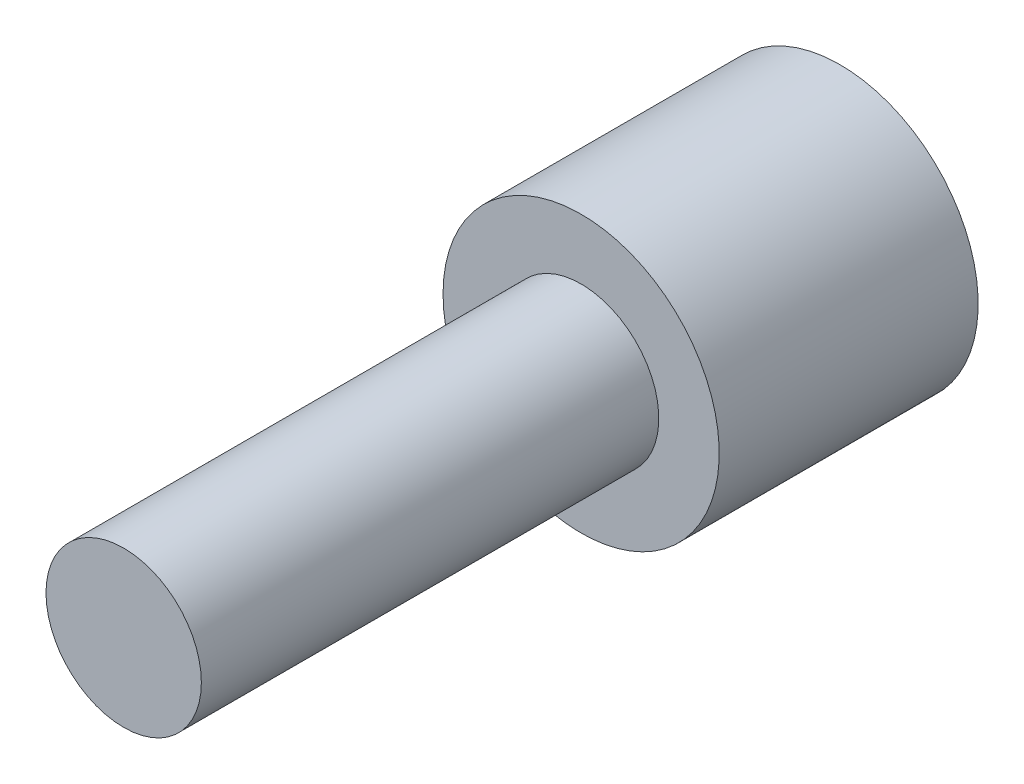
ISO-10303-21;
HEADER;
FILE_DESCRIPTION(('STEP AP214'),'2;1');
FILE_NAME('part.step','',(''),(''),'','','');
FILE_SCHEMA(('AUTOMOTIVE_DESIGN { 1 0 10303 214 1 1 1 1 }'));
ENDSEC;
DATA;
#1=APPLICATION_CONTEXT('core data for automotive mechanical design processes');
#2=APPLICATION_PROTOCOL_DEFINITION('international standard','automotive_design',2000,#1);
#3=PRODUCT_CONTEXT('',#1,'mechanical');
#4=PRODUCT('Part','Part','',(#3));
#5=PRODUCT_RELATED_PRODUCT_CATEGORY('part','',(#4));
#6=PRODUCT_DEFINITION_FORMATION('','',#4);
#7=PRODUCT_DEFINITION_CONTEXT('part definition',#1,'design');
#8=PRODUCT_DEFINITION('design','',#6,#7);
#9=PRODUCT_DEFINITION_SHAPE('','',#8);
#10=(LENGTH_UNIT() NAMED_UNIT(*) SI_UNIT(.MILLI.,.METRE.));
#11=(NAMED_UNIT(*) PLANE_ANGLE_UNIT() SI_UNIT($,.RADIAN.));
#12=(NAMED_UNIT(*) SI_UNIT($,.STERADIAN.) SOLID_ANGLE_UNIT());
#13=UNCERTAINTY_MEASURE_WITH_UNIT(LENGTH_MEASURE(1.E-05),#10,'distance_accuracy_value','');
#14=(GEOMETRIC_REPRESENTATION_CONTEXT(3) GLOBAL_UNCERTAINTY_ASSIGNED_CONTEXT((#13)) GLOBAL_UNIT_ASSIGNED_CONTEXT((#10,
#11,#12)) REPRESENTATION_CONTEXT('',''));
#15=CARTESIAN_POINT('',(0.,0.,0.));
#16=DIRECTION('',(0.,0.,1.));
#17=DIRECTION('',(1.,0.,0.));
#18=AXIS2_PLACEMENT_3D('',#15,#16,#17);
#19=CARTESIAN_POINT('',(0.,0.,16.6));
#20=DIRECTION('',(0.,0.,-1.));
#21=DIRECTION('',(-1.,0.,0.));
#22=AXIS2_PLACEMENT_3D('',#19,#20,#21);
#23=CYLINDRICAL_SURFACE('',#22,1.8);
#24=CARTESIAN_POINT('',(0.,0.,16.6));
#25=DIRECTION('',(0.,0.,1.));
#26=DIRECTION('',(1.,0.,0.));
#27=AXIS2_PLACEMENT_3D('',#24,#25,#26);
#28=CIRCLE('',#27,1.8);
#29=CARTESIAN_POINT('',(1.8,0.,16.6));
#30=VERTEX_POINT('',#29);
#31=EDGE_CURVE('E44',#30,#30,#28,.T.);
#32=ORIENTED_EDGE('',*,*,#31,.F.);
#33=EDGE_LOOP('',(#32));
#34=FACE_BOUND('',#33,.T.);
#35=CARTESIAN_POINT('',(0.,0.,6.));
#36=DIRECTION('',(0.,0.,-1.));
#37=DIRECTION('',(-1.,0.,0.));
#38=AXIS2_PLACEMENT_3D('',#35,#36,#37);
#39=CIRCLE('',#38,1.8);
#40=CARTESIAN_POINT('',(-1.8,0.,6.));
#41=VERTEX_POINT('',#40);
#42=EDGE_CURVE('E10',#41,#41,#39,.T.);
#43=ORIENTED_EDGE('',*,*,#42,.F.);
#44=EDGE_LOOP('',(#43));
#45=FACE_BOUND('',#44,.T.);
#46=ADVANCED_FACE('F37',(#34,#45),#23,.T.);
#47=CARTESIAN_POINT('',(0.,0.,16.6));
#48=DIRECTION('',(0.,0.,1.));
#49=DIRECTION('',(1.,0.,0.));
#50=AXIS2_PLACEMENT_3D('',#47,#48,#49);
#51=PLANE('',#50);
#52=ORIENTED_EDGE('',*,*,#31,.T.);
#53=EDGE_LOOP('',(#52));
#54=FACE_BOUND('',#53,.T.);
#55=ADVANCED_FACE('F66',(#54),#51,.T.);
#56=CARTESIAN_POINT('',(0.,0.,6.));
#57=DIRECTION('',(0.,0.,-1.));
#58=DIRECTION('',(-1.,0.,0.));
#59=AXIS2_PLACEMENT_3D('',#56,#57,#58);
#60=CYLINDRICAL_SURFACE('',#59,3.2);
#61=CARTESIAN_POINT('',(0.,0.,6.));
#62=DIRECTION('',(0.,0.,-1.));
#63=DIRECTION('',(-1.,0.,0.));
#64=AXIS2_PLACEMENT_3D('',#61,#62,#63);
#65=CIRCLE('',#64,3.2);
#66=CARTESIAN_POINT('',(-3.2,0.,6.));
#67=VERTEX_POINT('',#66);
#68=EDGE_CURVE('E49',#67,#67,#65,.T.);
#69=ORIENTED_EDGE('',*,*,#68,.T.);
#70=EDGE_LOOP('',(#69));
#71=FACE_BOUND('',#70,.T.);
#72=CARTESIAN_POINT('',(0.,0.,0.));
#73=DIRECTION('',(0.,0.,-1.));
#74=DIRECTION('',(-1.,0.,0.));
#75=AXIS2_PLACEMENT_3D('',#72,#73,#74);
#76=CIRCLE('',#75,3.2);
#77=CARTESIAN_POINT('',(-3.2,0.,0.));
#78=VERTEX_POINT('',#77);
#79=EDGE_CURVE('E54',#78,#78,#76,.T.);
#80=ORIENTED_EDGE('',*,*,#79,.F.);
#81=EDGE_LOOP('',(#80));
#82=FACE_BOUND('',#81,.T.);
#83=ADVANCED_FACE('F63',(#71,#82),#60,.T.);
#84=CARTESIAN_POINT('',(0.,0.,6.));
#85=DIRECTION('',(0.,0.,-1.));
#86=DIRECTION('',(-1.,0.,0.));
#87=AXIS2_PLACEMENT_3D('',#84,#85,#86);
#88=PLANE('',#87);
#89=ORIENTED_EDGE('',*,*,#42,.T.);
#90=EDGE_LOOP('',(#89));
#91=FACE_BOUND('',#90,.T.);
#92=ORIENTED_EDGE('',*,*,#68,.F.);
#93=EDGE_LOOP('',(#92));
#94=FACE_BOUND('',#93,.T.);
#95=ADVANCED_FACE('F65',(#91,#94),#88,.F.);
#96=CARTESIAN_POINT('',(0.,0.,0.));
#97=DIRECTION('',(0.,0.,1.));
#98=DIRECTION('',(1.,0.,0.));
#99=AXIS2_PLACEMENT_3D('',#96,#97,#98);
#100=PLANE('',#99);
#101=ORIENTED_EDGE('',*,*,#79,.T.);
#102=EDGE_LOOP('',(#101));
#103=FACE_BOUND('',#102,.T.);
#104=ADVANCED_FACE('F61',(#103),#100,.F.);
#105=CLOSED_SHELL('',(#46,#55,#83,#95,#104));
#106=MANIFOLD_SOLID_BREP('B2',#105);
#107=ADVANCED_BREP_SHAPE_REPRESENTATION('',(#18,#106),#14);
#108=SHAPE_DEFINITION_REPRESENTATION(#9,#107);
ENDSEC;
END-ISO-10303-21;
